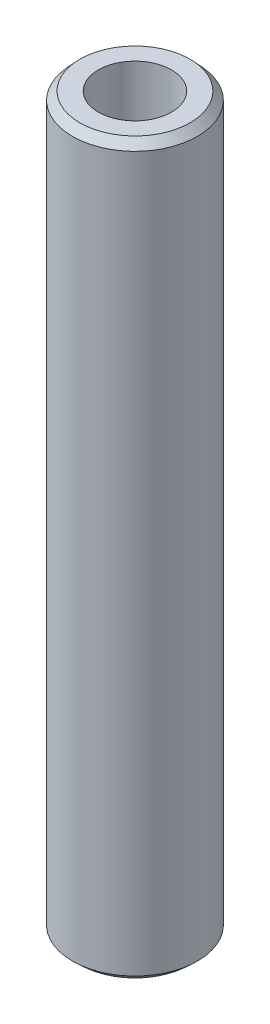
ISO-10303-21;
HEADER;
FILE_DESCRIPTION(('STEP AP214'),'2;1');
FILE_NAME('part.step','',(''),(''),'','','');
FILE_SCHEMA(('AUTOMOTIVE_DESIGN { 1 0 10303 214 1 1 1 1 }'));
ENDSEC;
DATA;
#1=APPLICATION_CONTEXT('core data for automotive mechanical design processes');
#2=APPLICATION_PROTOCOL_DEFINITION('international standard','automotive_design',2000,#1);
#3=PRODUCT_CONTEXT('',#1,'mechanical');
#4=PRODUCT('Part','Part','',(#3));
#5=PRODUCT_RELATED_PRODUCT_CATEGORY('part','',(#4));
#6=PRODUCT_DEFINITION_FORMATION('','',#4);
#7=PRODUCT_DEFINITION_CONTEXT('part definition',#1,'design');
#8=PRODUCT_DEFINITION('design','',#6,#7);
#9=PRODUCT_DEFINITION_SHAPE('','',#8);
#10=(LENGTH_UNIT() NAMED_UNIT(*) SI_UNIT(.MILLI.,.METRE.));
#11=(NAMED_UNIT(*) PLANE_ANGLE_UNIT() SI_UNIT($,.RADIAN.));
#12=(NAMED_UNIT(*) SI_UNIT($,.STERADIAN.) SOLID_ANGLE_UNIT());
#13=UNCERTAINTY_MEASURE_WITH_UNIT(LENGTH_MEASURE(1.E-05),#10,'distance_accuracy_value','');
#14=(GEOMETRIC_REPRESENTATION_CONTEXT(3) GLOBAL_UNCERTAINTY_ASSIGNED_CONTEXT((#13)) GLOBAL_UNIT_ASSIGNED_CONTEXT((#10,
#11,#12)) REPRESENTATION_CONTEXT('',''));
#15=CARTESIAN_POINT('',(0.,0.,0.));
#16=DIRECTION('',(0.,0.,1.));
#17=DIRECTION('',(1.,0.,0.));
#18=AXIS2_PLACEMENT_3D('',#15,#16,#17);
#19=CARTESIAN_POINT('',(0.,437.561603529974,0.));
#20=DIRECTION('',(0.,-1.,0.));
#21=DIRECTION('',(0.,0.,-1.));
#22=AXIS2_PLACEMENT_3D('',#19,#20,#21);
#23=CYLINDRICAL_SURFACE('',#22,37.5);
#24=CARTESIAN_POINT('',(0.,432.733101946036,0.));
#25=DIRECTION('',(0.,1.,0.));
#26=DIRECTION('',(0.,0.,1.));
#27=AXIS2_PLACEMENT_3D('',#24,#25,#26);
#28=CIRCLE('',#27,37.5);
#29=CARTESIAN_POINT('',(0.,432.733101946036,37.5));
#30=VERTEX_POINT('',#29);
#31=EDGE_CURVE('E50',#30,#30,#28,.F.);
#32=ORIENTED_EDGE('',*,*,#31,.T.);
#33=EDGE_LOOP('',(#32));
#34=FACE_BOUND('',#33,.T.);
#35=CARTESIAN_POINT('',(0.,4.44346837057569,0.));
#36=DIRECTION('',(0.,1.,0.));
#37=DIRECTION('',(0.,0.,1.));
#38=AXIS2_PLACEMENT_3D('',#35,#36,#37);
#39=CIRCLE('',#38,37.5);
#40=CARTESIAN_POINT('',(0.,4.44346837057569,37.5));
#41=VERTEX_POINT('',#40);
#42=EDGE_CURVE('E51',#41,#41,#39,.T.);
#43=ORIENTED_EDGE('',*,*,#42,.T.);
#44=EDGE_LOOP('',(#43));
#45=FACE_BOUND('',#44,.T.);
#46=ADVANCED_FACE('F39',(#34,#45),#23,.T.);
#47=CARTESIAN_POINT('',(0.,437.561603529974,0.));
#48=DIRECTION('',(0.,1.,0.));
#49=DIRECTION('',(0.,0.,1.));
#50=AXIS2_PLACEMENT_3D('',#47,#48,#49);
#51=PLANE('',#50);
#52=CARTESIAN_POINT('',(0.,437.561603529974,0.));
#53=DIRECTION('',(0.,1.,0.));
#54=DIRECTION('',(0.,0.,1.));
#55=AXIS2_PLACEMENT_3D('',#52,#53,#54);
#56=CIRCLE('',#55,33.0565316294243);
#57=CARTESIAN_POINT('',(0.,437.561603529974,33.0565316294243));
#58=VERTEX_POINT('',#57);
#59=EDGE_CURVE('E54',#58,#58,#56,.T.);
#60=ORIENTED_EDGE('',*,*,#59,.T.);
#61=EDGE_LOOP('',(#60));
#62=FACE_BOUND('',#61,.T.);
#63=CARTESIAN_POINT('',(0.,437.561603529974,0.));
#64=DIRECTION('',(0.,1.,0.));
#65=DIRECTION('',(0.,0.,1.));
#66=AXIS2_PLACEMENT_3D('',#63,#64,#65);
#67=CIRCLE('',#66,21.9628927700149);
#68=CARTESIAN_POINT('',(0.,437.561603529974,21.9628927700149));
#69=VERTEX_POINT('',#68);
#70=EDGE_CURVE('E58',#69,#69,#67,.T.);
#71=ORIENTED_EDGE('',*,*,#70,.F.);
#72=EDGE_LOOP('',(#71));
#73=FACE_BOUND('',#72,.T.);
#74=ADVANCED_FACE('F69',(#62,#73),#51,.T.);
#75=CARTESIAN_POINT('',(0.,0.,0.));
#76=DIRECTION('',(0.,1.,0.));
#77=DIRECTION('',(0.,0.,1.));
#78=AXIS2_PLACEMENT_3D('',#75,#76,#77);
#79=PLANE('',#78);
#80=CARTESIAN_POINT('',(0.,0.,0.));
#81=DIRECTION('',(0.,1.,0.));
#82=DIRECTION('',(0.,0.,1.));
#83=AXIS2_PLACEMENT_3D('',#80,#81,#82);
#84=CIRCLE('',#83,32.6714984160617);
#85=CARTESIAN_POINT('',(0.,0.,32.6714984160617));
#86=VERTEX_POINT('',#85);
#87=EDGE_CURVE('E10',#86,#86,#84,.F.);
#88=ORIENTED_EDGE('',*,*,#87,.T.);
#89=EDGE_LOOP('',(#88));
#90=FACE_BOUND('',#89,.T.);
#91=CARTESIAN_POINT('',(0.,0.,0.));
#92=DIRECTION('',(0.,1.,0.));
#93=DIRECTION('',(0.,0.,1.));
#94=AXIS2_PLACEMENT_3D('',#91,#92,#93);
#95=CIRCLE('',#94,21.9628927700149);
#96=CARTESIAN_POINT('',(0.,0.,21.9628927700149));
#97=VERTEX_POINT('',#96);
#98=EDGE_CURVE('E63',#97,#97,#95,.T.);
#99=ORIENTED_EDGE('',*,*,#98,.T.);
#100=EDGE_LOOP('',(#99));
#101=FACE_BOUND('',#100,.T.);
#102=ADVANCED_FACE('F75',(#90,#101),#79,.F.);
#103=CARTESIAN_POINT('',(0.,437.561603529974,0.));
#104=DIRECTION('',(0.,-1.,0.));
#105=DIRECTION('',(0.,0.,-1.));
#106=AXIS2_PLACEMENT_3D('',#103,#104,#105);
#107=CYLINDRICAL_SURFACE('',#106,21.9628927700149);
#108=ORIENTED_EDGE('',*,*,#70,.T.);
#109=EDGE_LOOP('',(#108));
#110=FACE_BOUND('',#109,.T.);
#111=ORIENTED_EDGE('',*,*,#98,.F.);
#112=EDGE_LOOP('',(#111));
#113=FACE_BOUND('',#112,.T.);
#114=ADVANCED_FACE('F70',(#110,#113),#107,.F.);
#115=CARTESIAN_POINT('',(0.,437.561603529974,0.));
#116=DIRECTION('',(0.,-1.,0.));
#117=DIRECTION('',(0.,0.,-1.));
#118=AXIS2_PLACEMENT_3D('',#115,#116,#117);
#119=CONICAL_SURFACE('',#118,33.0565316294243,0.743895427779521);
#120=ORIENTED_EDGE('',*,*,#31,.F.);
#121=EDGE_LOOP('',(#120));
#122=FACE_BOUND('',#121,.T.);
#123=ORIENTED_EDGE('',*,*,#59,.F.);
#124=EDGE_LOOP('',(#123));
#125=FACE_BOUND('',#124,.T.);
#126=ADVANCED_FACE('F81',(#122,#125),#119,.T.);
#127=CARTESIAN_POINT('',(0.,4.44346837057569,0.));
#128=DIRECTION('',(0.,1.,0.));
#129=DIRECTION('',(0.,0.,1.));
#130=AXIS2_PLACEMENT_3D('',#127,#128,#129);
#131=CONICAL_SURFACE('',#130,37.5,0.826900899015381);
#132=ORIENTED_EDGE('',*,*,#87,.F.);
#133=EDGE_LOOP('',(#132));
#134=FACE_BOUND('',#133,.T.);
#135=ORIENTED_EDGE('',*,*,#42,.F.);
#136=EDGE_LOOP('',(#135));
#137=FACE_BOUND('',#136,.T.);
#138=ADVANCED_FACE('F45',(#134,#137),#131,.T.);
#139=CLOSED_SHELL('',(#46,#74,#102,#114,#126,#138));
#140=MANIFOLD_SOLID_BREP('B2',#139);
#141=ADVANCED_BREP_SHAPE_REPRESENTATION('',(#18,#140),#14);
#142=SHAPE_DEFINITION_REPRESENTATION(#9,#141);
ENDSEC;
END-ISO-10303-21;
